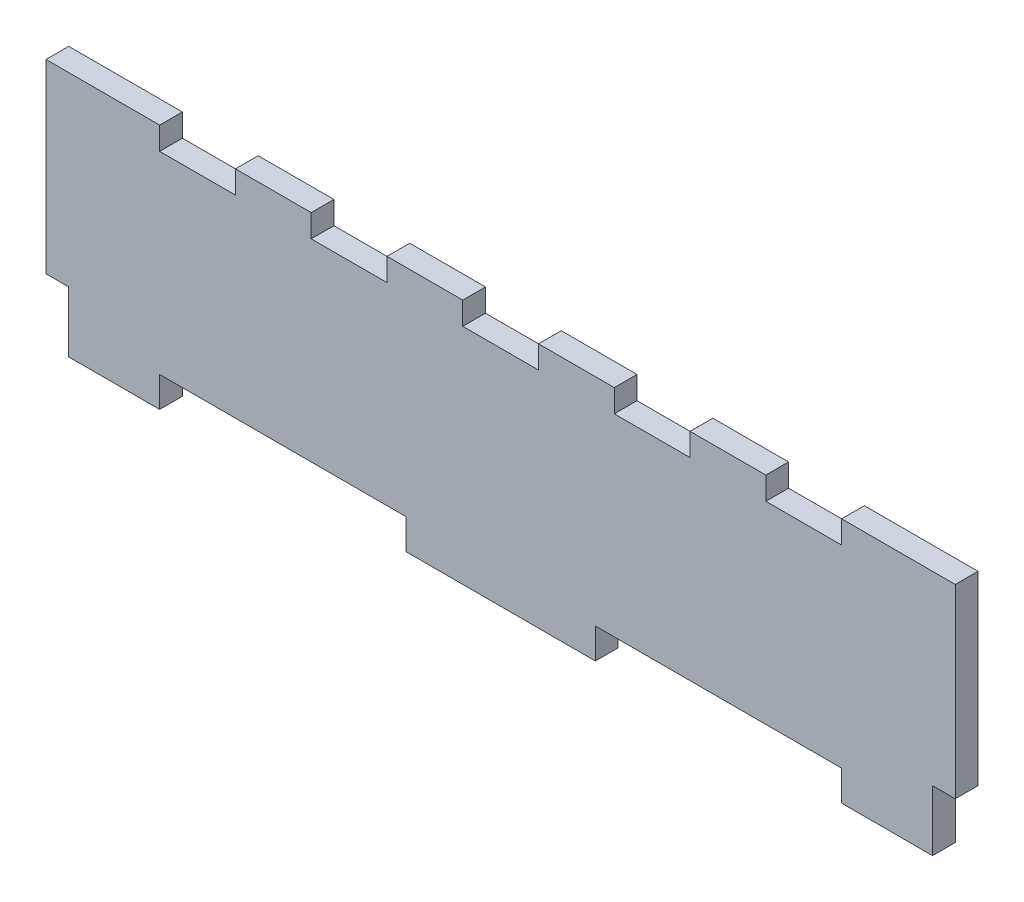
ISO-10303-21;
HEADER;
FILE_DESCRIPTION(('STEP AP214'),'2;1');
FILE_NAME('part.step','',(''),(''),'','','');
FILE_SCHEMA(('AUTOMOTIVE_DESIGN { 1 0 10303 214 1 1 1 1 }'));
ENDSEC;
DATA;
#1=APPLICATION_CONTEXT('core data for automotive mechanical design processes');
#2=APPLICATION_PROTOCOL_DEFINITION('international standard','automotive_design',2000,#1);
#3=PRODUCT_CONTEXT('',#1,'mechanical');
#4=PRODUCT('Part','Part','',(#3));
#5=PRODUCT_RELATED_PRODUCT_CATEGORY('part','',(#4));
#6=PRODUCT_DEFINITION_FORMATION('','',#4);
#7=PRODUCT_DEFINITION_CONTEXT('part definition',#1,'design');
#8=PRODUCT_DEFINITION('design','',#6,#7);
#9=PRODUCT_DEFINITION_SHAPE('','',#8);
#10=(LENGTH_UNIT() NAMED_UNIT(*) SI_UNIT(.MILLI.,.METRE.));
#11=(NAMED_UNIT(*) PLANE_ANGLE_UNIT() SI_UNIT($,.RADIAN.));
#12=(NAMED_UNIT(*) SI_UNIT($,.STERADIAN.) SOLID_ANGLE_UNIT());
#13=UNCERTAINTY_MEASURE_WITH_UNIT(LENGTH_MEASURE(1.E-05),#10,'distance_accuracy_value','');
#14=(GEOMETRIC_REPRESENTATION_CONTEXT(3) GLOBAL_UNCERTAINTY_ASSIGNED_CONTEXT((#13)) GLOBAL_UNIT_ASSIGNED_CONTEXT((#10,
#11,#12)) REPRESENTATION_CONTEXT('',''));
#15=CARTESIAN_POINT('',(0.,0.,0.));
#16=DIRECTION('',(0.,0.,1.));
#17=DIRECTION('',(1.,0.,0.));
#18=AXIS2_PLACEMENT_3D('',#15,#16,#17);
#19=CARTESIAN_POINT('',(-120.,32.5,3.));
#20=DIRECTION('',(0.,-1.,0.));
#21=DIRECTION('',(0.,0.,-1.));
#22=AXIS2_PLACEMENT_3D('',#19,#20,#21);
#23=PLANE('',#22);
#24=DIRECTION('',(-1.,0.,0.));
#25=VECTOR('',#24,1.);
#26=CARTESIAN_POINT('',(-120.,32.5,-3.));
#27=LINE('',#26,#25);
#28=CARTESIAN_POINT('',(-9.99999999999998,32.5,-3.));
#29=VERTEX_POINT('',#28);
#30=CARTESIAN_POINT('',(-30.,32.5,-3.));
#31=VERTEX_POINT('',#30);
#32=EDGE_CURVE('E564',#29,#31,#27,.T.);
#33=ORIENTED_EDGE('',*,*,#32,.T.);
#34=DIRECTION('',(0.,0.,1.));
#35=VECTOR('',#34,1.);
#36=CARTESIAN_POINT('',(-30.,32.5,-23.8806130178211));
#37=LINE('',#36,#35);
#38=CARTESIAN_POINT('',(-30.,32.5,3.));
#39=VERTEX_POINT('',#38);
#40=EDGE_CURVE('E273',#31,#39,#37,.T.);
#41=ORIENTED_EDGE('',*,*,#40,.T.);
#42=DIRECTION('',(-1.,0.,0.));
#43=VECTOR('',#42,1.);
#44=CARTESIAN_POINT('',(-120.,32.5,3.));
#45=LINE('',#44,#43);
#46=CARTESIAN_POINT('',(-9.99999999999998,32.5,3.));
#47=VERTEX_POINT('',#46);
#48=EDGE_CURVE('E549',#47,#39,#45,.T.);
#49=ORIENTED_EDGE('',*,*,#48,.F.);
#50=DIRECTION('',(0.,0.,1.));
#51=VECTOR('',#50,1.);
#52=CARTESIAN_POINT('',(-9.99999999999998,32.5,-23.8806130178211));
#53=LINE('',#52,#51);
#54=EDGE_CURVE('E318',#29,#47,#53,.T.);
#55=ORIENTED_EDGE('',*,*,#54,.F.);
#56=EDGE_LOOP('',(#33,#41,#49,#55));
#57=FACE_BOUND('',#56,.T.);
#58=ADVANCED_FACE('F35',(#57),#23,.F.);
#59=CARTESIAN_POINT('',(30.,32.5,-3.));
#60=VERTEX_POINT('',#59);
#61=CARTESIAN_POINT('',(10.,32.5,-3.));
#62=VERTEX_POINT('',#61);
#63=EDGE_CURVE('E565',#60,#62,#27,.T.);
#64=ORIENTED_EDGE('',*,*,#63,.T.);
#65=DIRECTION('',(0.,0.,1.));
#66=VECTOR('',#65,1.);
#67=CARTESIAN_POINT('',(10.,32.5,-23.8806130178211));
#68=LINE('',#67,#66);
#69=CARTESIAN_POINT('',(10.,32.5,3.));
#70=VERTEX_POINT('',#69);
#71=EDGE_CURVE('E322',#62,#70,#68,.T.);
#72=ORIENTED_EDGE('',*,*,#71,.T.);
#73=CARTESIAN_POINT('',(30.,32.5,3.));
#74=VERTEX_POINT('',#73);
#75=EDGE_CURVE('E551',#74,#70,#45,.T.);
#76=ORIENTED_EDGE('',*,*,#75,.F.);
#77=DIRECTION('',(0.,0.,1.));
#78=VECTOR('',#77,1.);
#79=CARTESIAN_POINT('',(30.,32.5,-23.8806130178211));
#80=LINE('',#79,#78);
#81=EDGE_CURVE('E344',#60,#74,#80,.T.);
#82=ORIENTED_EDGE('',*,*,#81,.F.);
#83=EDGE_LOOP('',(#64,#72,#76,#82));
#84=FACE_BOUND('',#83,.T.);
#85=ADVANCED_FACE('F585',(#84),#23,.F.);
#86=CARTESIAN_POINT('',(70.,32.5,-3.));
#87=VERTEX_POINT('',#86);
#88=CARTESIAN_POINT('',(50.,32.5,-3.));
#89=VERTEX_POINT('',#88);
#90=EDGE_CURVE('E517',#87,#89,#27,.T.);
#91=ORIENTED_EDGE('',*,*,#90,.T.);
#92=DIRECTION('',(0.,0.,1.));
#93=VECTOR('',#92,1.);
#94=CARTESIAN_POINT('',(50.,32.5,-23.8806130178211));
#95=LINE('',#94,#93);
#96=CARTESIAN_POINT('',(50.,32.5,3.));
#97=VERTEX_POINT('',#96);
#98=EDGE_CURVE('E348',#89,#97,#95,.T.);
#99=ORIENTED_EDGE('',*,*,#98,.T.);
#100=CARTESIAN_POINT('',(70.,32.5,3.));
#101=VERTEX_POINT('',#100);
#102=EDGE_CURVE('E502',#101,#97,#45,.T.);
#103=ORIENTED_EDGE('',*,*,#102,.F.);
#104=DIRECTION('',(0.,0.,1.));
#105=VECTOR('',#104,1.);
#106=CARTESIAN_POINT('',(70.,32.5,-23.8806130178211));
#107=LINE('',#106,#105);
#108=EDGE_CURVE('E369',#87,#101,#107,.T.);
#109=ORIENTED_EDGE('',*,*,#108,.F.);
#110=EDGE_LOOP('',(#91,#99,#103,#109));
#111=FACE_BOUND('',#110,.T.);
#112=ADVANCED_FACE('F574',(#111),#23,.F.);
#113=CARTESIAN_POINT('',(120.,32.5,-3.));
#114=VERTEX_POINT('',#113);
#115=CARTESIAN_POINT('',(90.,32.5,-3.));
#116=VERTEX_POINT('',#115);
#117=EDGE_CURVE('E513',#114,#116,#27,.T.);
#118=ORIENTED_EDGE('',*,*,#117,.T.);
#119=DIRECTION('',(0.,0.,1.));
#120=VECTOR('',#119,1.);
#121=CARTESIAN_POINT('',(90.,32.5,-23.8806130178211));
#122=LINE('',#121,#120);
#123=CARTESIAN_POINT('',(90.,32.5,3.));
#124=VERTEX_POINT('',#123);
#125=EDGE_CURVE('E373',#116,#124,#122,.T.);
#126=ORIENTED_EDGE('',*,*,#125,.T.);
#127=CARTESIAN_POINT('',(120.,32.5,3.));
#128=VERTEX_POINT('',#127);
#129=EDGE_CURVE('E498',#128,#124,#45,.T.);
#130=ORIENTED_EDGE('',*,*,#129,.F.);
#131=DIRECTION('',(0.,0.,-1.));
#132=VECTOR('',#131,1.);
#133=CARTESIAN_POINT('',(120.,32.5,3.));
#134=LINE('',#133,#132);
#135=EDGE_CURVE('E11',#128,#114,#134,.T.);
#136=ORIENTED_EDGE('',*,*,#135,.T.);
#137=EDGE_LOOP('',(#118,#126,#130,#136));
#138=FACE_BOUND('',#137,.T.);
#139=ADVANCED_FACE('F618',(#138),#23,.F.);
#140=CARTESIAN_POINT('',(-50.,32.5,3.));
#141=VERTEX_POINT('',#140);
#142=CARTESIAN_POINT('',(-70.,32.5,3.));
#143=VERTEX_POINT('',#142);
#144=EDGE_CURVE('E503',#141,#143,#45,.T.);
#145=ORIENTED_EDGE('',*,*,#144,.F.);
#146=DIRECTION('',(0.,0.,1.));
#147=VECTOR('',#146,1.);
#148=CARTESIAN_POINT('',(-50.,32.5,-23.8806130178211));
#149=LINE('',#148,#147);
#150=CARTESIAN_POINT('',(-50.,32.5,-3.));
#151=VERTEX_POINT('',#150);
#152=EDGE_CURVE('E297',#151,#141,#149,.T.);
#153=ORIENTED_EDGE('',*,*,#152,.F.);
#154=CARTESIAN_POINT('',(-70.,32.5,-3.));
#155=VERTEX_POINT('',#154);
#156=EDGE_CURVE('E518',#151,#155,#27,.T.);
#157=ORIENTED_EDGE('',*,*,#156,.T.);
#158=DIRECTION('',(0.,0.,1.));
#159=VECTOR('',#158,1.);
#160=CARTESIAN_POINT('',(-70.,32.5,-23.8806130178211));
#161=LINE('',#160,#159);
#162=EDGE_CURVE('E399',#155,#143,#161,.T.);
#163=ORIENTED_EDGE('',*,*,#162,.T.);
#164=EDGE_LOOP('',(#145,#153,#157,#163));
#165=FACE_BOUND('',#164,.T.);
#166=ADVANCED_FACE('F608',(#165),#23,.F.);
#167=CARTESIAN_POINT('',(-120.,-32.5,3.));
#168=DIRECTION('',(0.,1.,0.));
#169=DIRECTION('',(0.,0.,1.));
#170=AXIS2_PLACEMENT_3D('',#167,#168,#169);
#171=PLANE('',#170);
#172=DIRECTION('',(1.,0.,0.));
#173=VECTOR('',#172,1.);
#174=CARTESIAN_POINT('',(-120.,-32.5,3.));
#175=LINE('',#174,#173);
#176=CARTESIAN_POINT('',(-25.,-32.5,3.));
#177=VERTEX_POINT('',#176);
#178=CARTESIAN_POINT('',(25.,-32.5,3.));
#179=VERTEX_POINT('',#178);
#180=EDGE_CURVE('E510',#177,#179,#175,.T.);
#181=ORIENTED_EDGE('',*,*,#180,.F.);
#182=DIRECTION('',(0.,0.,1.));
#183=VECTOR('',#182,1.);
#184=CARTESIAN_POINT('',(-25.,-32.5,-68.4904573201318));
#185=LINE('',#184,#183);
#186=CARTESIAN_POINT('',(-25.,-32.5,-3.));
#187=VERTEX_POINT('',#186);
#188=EDGE_CURVE('E409',#187,#177,#185,.T.);
#189=ORIENTED_EDGE('',*,*,#188,.F.);
#190=DIRECTION('',(1.,0.,0.));
#191=VECTOR('',#190,1.);
#192=CARTESIAN_POINT('',(-120.,-32.5,-3.));
#193=LINE('',#192,#191);
#194=CARTESIAN_POINT('',(25.,-32.5,-3.));
#195=VERTEX_POINT('',#194);
#196=EDGE_CURVE('E523',#187,#195,#193,.T.);
#197=ORIENTED_EDGE('',*,*,#196,.T.);
#198=DIRECTION('',(0.,0.,1.));
#199=VECTOR('',#198,1.);
#200=CARTESIAN_POINT('',(25.,-32.5,-68.4904573201318));
#201=LINE('',#200,#199);
#202=EDGE_CURVE('E450',#195,#179,#201,.T.);
#203=ORIENTED_EDGE('',*,*,#202,.T.);
#204=EDGE_LOOP('',(#181,#189,#197,#203));
#205=FACE_BOUND('',#204,.T.);
#206=ADVANCED_FACE('F617',(#205),#171,.F.);
#207=CARTESIAN_POINT('',(90.,-32.5,3.));
#208=VERTEX_POINT('',#207);
#209=CARTESIAN_POINT('',(114.,-32.5,3.));
#210=VERTEX_POINT('',#209);
#211=EDGE_CURVE('E506',#208,#210,#175,.T.);
#212=ORIENTED_EDGE('',*,*,#211,.F.);
#213=DIRECTION('',(0.,0.,1.));
#214=VECTOR('',#213,1.);
#215=CARTESIAN_POINT('',(90.,-32.5,-68.4904573201318));
#216=LINE('',#215,#214);
#217=CARTESIAN_POINT('',(90.,-32.5,-3.));
#218=VERTEX_POINT('',#217);
#219=EDGE_CURVE('E415',#218,#208,#216,.T.);
#220=ORIENTED_EDGE('',*,*,#219,.F.);
#221=CARTESIAN_POINT('',(114.,-32.5,-3.));
#222=VERTEX_POINT('',#221);
#223=EDGE_CURVE('E521',#218,#222,#193,.T.);
#224=ORIENTED_EDGE('',*,*,#223,.T.);
#225=DIRECTION('',(0.,0.,1.));
#226=VECTOR('',#225,1.);
#227=CARTESIAN_POINT('',(114.,-32.5,-68.4904573201318));
#228=LINE('',#227,#226);
#229=EDGE_CURVE('E443',#222,#210,#228,.T.);
#230=ORIENTED_EDGE('',*,*,#229,.T.);
#231=EDGE_LOOP('',(#212,#220,#224,#230));
#232=FACE_BOUND('',#231,.T.);
#233=ADVANCED_FACE('F614',(#232),#171,.F.);
#234=CARTESIAN_POINT('',(120.,-32.5,3.));
#235=DIRECTION('',(-1.,0.,0.));
#236=DIRECTION('',(0.,0.,1.));
#237=AXIS2_PLACEMENT_3D('',#234,#235,#236);
#238=PLANE('',#237);
#239=DIRECTION('',(0.,1.,0.));
#240=VECTOR('',#239,1.);
#241=CARTESIAN_POINT('',(120.,-32.5,3.));
#242=LINE('',#241,#240);
#243=CARTESIAN_POINT('',(120.,-16.5,3.));
#244=VERTEX_POINT('',#243);
#245=EDGE_CURVE('E494',#244,#128,#242,.T.);
#246=ORIENTED_EDGE('',*,*,#245,.F.);
#247=DIRECTION('',(0.,0.,1.));
#248=VECTOR('',#247,1.);
#249=CARTESIAN_POINT('',(120.,-16.5,-68.4904573201318));
#250=LINE('',#249,#248);
#251=CARTESIAN_POINT('',(120.,-16.5,-3.));
#252=VERTEX_POINT('',#251);
#253=EDGE_CURVE('E462',#252,#244,#250,.T.);
#254=ORIENTED_EDGE('',*,*,#253,.F.);
#255=DIRECTION('',(0.,1.,0.));
#256=VECTOR('',#255,1.);
#257=CARTESIAN_POINT('',(120.,-32.5,-3.));
#258=LINE('',#257,#256);
#259=EDGE_CURVE('E491',#252,#114,#258,.T.);
#260=ORIENTED_EDGE('',*,*,#259,.T.);
#261=ORIENTED_EDGE('',*,*,#135,.F.);
#262=EDGE_LOOP('',(#246,#254,#260,#261));
#263=FACE_BOUND('',#262,.T.);
#264=ADVANCED_FACE('F37',(#263),#238,.F.);
#265=CARTESIAN_POINT('',(-90.,32.5,3.));
#266=VERTEX_POINT('',#265);
#267=CARTESIAN_POINT('',(-120.,32.5,3.));
#268=VERTEX_POINT('',#267);
#269=EDGE_CURVE('E496',#266,#268,#45,.T.);
#270=ORIENTED_EDGE('',*,*,#269,.F.);
#271=DIRECTION('',(0.,0.,1.));
#272=VECTOR('',#271,1.);
#273=CARTESIAN_POINT('',(-90.,32.5,-23.8806130178211));
#274=LINE('',#273,#272);
#275=CARTESIAN_POINT('',(-90.,32.5,-3.));
#276=VERTEX_POINT('',#275);
#277=EDGE_CURVE('E395',#276,#266,#274,.T.);
#278=ORIENTED_EDGE('',*,*,#277,.F.);
#279=CARTESIAN_POINT('',(-120.,32.5,-3.));
#280=VERTEX_POINT('',#279);
#281=EDGE_CURVE('E512',#276,#280,#27,.T.);
#282=ORIENTED_EDGE('',*,*,#281,.T.);
#283=DIRECTION('',(0.,0.,-1.));
#284=VECTOR('',#283,1.);
#285=CARTESIAN_POINT('',(-120.,32.5,3.));
#286=LINE('',#285,#284);
#287=EDGE_CURVE('E43',#268,#280,#286,.T.);
#288=ORIENTED_EDGE('',*,*,#287,.F.);
#289=EDGE_LOOP('',(#270,#278,#282,#288));
#290=FACE_BOUND('',#289,.T.);
#291=ADVANCED_FACE('F602',(#290),#23,.F.);
#292=CARTESIAN_POINT('',(-120.,-32.5,3.));
#293=DIRECTION('',(1.,0.,0.));
#294=DIRECTION('',(0.,0.,-1.));
#295=AXIS2_PLACEMENT_3D('',#292,#293,#294);
#296=PLANE('',#295);
#297=DIRECTION('',(0.,-1.,0.));
#298=VECTOR('',#297,1.);
#299=CARTESIAN_POINT('',(-120.,-32.5,-3.));
#300=LINE('',#299,#298);
#301=CARTESIAN_POINT('',(-120.,-16.5,-3.));
#302=VERTEX_POINT('',#301);
#303=EDGE_CURVE('E516',#280,#302,#300,.T.);
#304=ORIENTED_EDGE('',*,*,#303,.T.);
#305=DIRECTION('',(0.,0.,1.));
#306=VECTOR('',#305,1.);
#307=CARTESIAN_POINT('',(-120.,-16.5,-68.4904573201318));
#308=LINE('',#307,#306);
#309=CARTESIAN_POINT('',(-120.,-16.5,3.));
#310=VERTEX_POINT('',#309);
#311=EDGE_CURVE('E484',#302,#310,#308,.T.);
#312=ORIENTED_EDGE('',*,*,#311,.T.);
#313=DIRECTION('',(0.,-1.,0.));
#314=VECTOR('',#313,1.);
#315=CARTESIAN_POINT('',(-120.,-32.5,3.));
#316=LINE('',#315,#314);
#317=EDGE_CURVE('E501',#268,#310,#316,.T.);
#318=ORIENTED_EDGE('',*,*,#317,.F.);
#319=ORIENTED_EDGE('',*,*,#287,.T.);
#320=EDGE_LOOP('',(#304,#312,#318,#319));
#321=FACE_BOUND('',#320,.T.);
#322=ADVANCED_FACE('F529',(#321),#296,.F.);
#323=CARTESIAN_POINT('',(-114.,-32.5,-3.));
#324=VERTEX_POINT('',#323);
#325=CARTESIAN_POINT('',(-90.,-32.5,-3.));
#326=VERTEX_POINT('',#325);
#327=EDGE_CURVE('E497',#324,#326,#193,.T.);
#328=ORIENTED_EDGE('',*,*,#327,.T.);
#329=DIRECTION('',(0.,0.,1.));
#330=VECTOR('',#329,1.);
#331=CARTESIAN_POINT('',(-90.,-32.5,-68.4904573201318));
#332=LINE('',#331,#330);
#333=CARTESIAN_POINT('',(-90.,-32.5,3.));
#334=VERTEX_POINT('',#333);
#335=EDGE_CURVE('E419',#326,#334,#332,.T.);
#336=ORIENTED_EDGE('',*,*,#335,.T.);
#337=CARTESIAN_POINT('',(-114.,-32.5,3.));
#338=VERTEX_POINT('',#337);
#339=EDGE_CURVE('E507',#338,#334,#175,.T.);
#340=ORIENTED_EDGE('',*,*,#339,.F.);
#341=DIRECTION('',(0.,0.,1.));
#342=VECTOR('',#341,1.);
#343=CARTESIAN_POINT('',(-114.,-32.5,-68.4904573201318));
#344=LINE('',#343,#342);
#345=EDGE_CURVE('E478',#324,#338,#344,.T.);
#346=ORIENTED_EDGE('',*,*,#345,.F.);
#347=EDGE_LOOP('',(#328,#336,#340,#346));
#348=FACE_BOUND('',#347,.T.);
#349=ADVANCED_FACE('F613',(#348),#171,.F.);
#350=CARTESIAN_POINT('',(0.,0.,3.));
#351=DIRECTION('',(0.,0.,-1.));
#352=DIRECTION('',(-1.,0.,0.));
#353=AXIS2_PLACEMENT_3D('',#350,#351,#352);
#354=PLANE('',#353);
#355=ORIENTED_EDGE('',*,*,#48,.T.);
#356=DIRECTION('',(0.,1.,0.));
#357=VECTOR('',#356,1.);
#358=CARTESIAN_POINT('',(-30.,32.5,3.));
#359=LINE('',#358,#357);
#360=CARTESIAN_POINT('',(-30.,26.5,3.));
#361=VERTEX_POINT('',#360);
#362=EDGE_CURVE('E290',#361,#39,#359,.T.);
#363=ORIENTED_EDGE('',*,*,#362,.F.);
#364=DIRECTION('',(1.,0.,0.));
#365=VECTOR('',#364,1.);
#366=CARTESIAN_POINT('',(-50.,26.5,3.));
#367=LINE('',#366,#365);
#368=CARTESIAN_POINT('',(-50.,26.5,3.));
#369=VERTEX_POINT('',#368);
#370=EDGE_CURVE('E284',#369,#361,#367,.T.);
#371=ORIENTED_EDGE('',*,*,#370,.F.);
#372=DIRECTION('',(0.,-1.,0.));
#373=VECTOR('',#372,1.);
#374=CARTESIAN_POINT('',(-50.,32.5,3.));
#375=LINE('',#374,#373);
#376=EDGE_CURVE('E295',#141,#369,#375,.T.);
#377=ORIENTED_EDGE('',*,*,#376,.F.);
#378=ORIENTED_EDGE('',*,*,#144,.T.);
#379=DIRECTION('',(0.,1.,0.));
#380=VECTOR('',#379,1.);
#381=CARTESIAN_POINT('',(-70.,32.5,3.));
#382=LINE('',#381,#380);
#383=CARTESIAN_POINT('',(-70.,26.5,3.));
#384=VERTEX_POINT('',#383);
#385=EDGE_CURVE('E379',#384,#143,#382,.T.);
#386=ORIENTED_EDGE('',*,*,#385,.F.);
#387=DIRECTION('',(1.,0.,0.));
#388=VECTOR('',#387,1.);
#389=CARTESIAN_POINT('',(-90.,26.5,3.));
#390=LINE('',#389,#388);
#391=CARTESIAN_POINT('',(-90.,26.5,3.));
#392=VERTEX_POINT('',#391);
#393=EDGE_CURVE('E383',#392,#384,#390,.T.);
#394=ORIENTED_EDGE('',*,*,#393,.F.);
#395=DIRECTION('',(0.,-1.,0.));
#396=VECTOR('',#395,1.);
#397=CARTESIAN_POINT('',(-90.,32.5,3.));
#398=LINE('',#397,#396);
#399=EDGE_CURVE('E302',#266,#392,#398,.T.);
#400=ORIENTED_EDGE('',*,*,#399,.F.);
#401=ORIENTED_EDGE('',*,*,#269,.T.);
#402=ORIENTED_EDGE('',*,*,#317,.T.);
#403=DIRECTION('',(-1.,0.,0.));
#404=VECTOR('',#403,1.);
#405=CARTESIAN_POINT('',(-120.,-16.5,3.));
#406=LINE('',#405,#404);
#407=CARTESIAN_POINT('',(-114.,-16.5,3.));
#408=VERTEX_POINT('',#407);
#409=EDGE_CURVE('E476',#408,#310,#406,.T.);
#410=ORIENTED_EDGE('',*,*,#409,.F.);
#411=DIRECTION('',(0.,1.,0.));
#412=VECTOR('',#411,1.);
#413=CARTESIAN_POINT('',(-114.,-32.5,3.));
#414=LINE('',#413,#412);
#415=EDGE_CURVE('E433',#338,#408,#414,.T.);
#416=ORIENTED_EDGE('',*,*,#415,.F.);
#417=ORIENTED_EDGE('',*,*,#339,.T.);
#418=DIRECTION('',(0.,-1.,0.));
#419=VECTOR('',#418,1.);
#420=CARTESIAN_POINT('',(-90.,-32.5,3.));
#421=LINE('',#420,#419);
#422=CARTESIAN_POINT('',(-90.,-24.5,3.));
#423=VERTEX_POINT('',#422);
#424=EDGE_CURVE('E413',#423,#334,#421,.T.);
#425=ORIENTED_EDGE('',*,*,#424,.F.);
#426=DIRECTION('',(-1.,0.,0.));
#427=VECTOR('',#426,1.);
#428=CARTESIAN_POINT('',(-90.,-24.5,3.));
#429=LINE('',#428,#427);
#430=CARTESIAN_POINT('',(-25.,-24.5,3.));
#431=VERTEX_POINT('',#430);
#432=EDGE_CURVE('E406',#431,#423,#429,.T.);
#433=ORIENTED_EDGE('',*,*,#432,.F.);
#434=DIRECTION('',(0.,1.,0.));
#435=VECTOR('',#434,1.);
#436=CARTESIAN_POINT('',(-25.,-32.5,3.));
#437=LINE('',#436,#435);
#438=EDGE_CURVE('E410',#177,#431,#437,.T.);
#439=ORIENTED_EDGE('',*,*,#438,.F.);
#440=ORIENTED_EDGE('',*,*,#180,.T.);
#441=DIRECTION('',(0.,-1.,0.));
#442=VECTOR('',#441,1.);
#443=CARTESIAN_POINT('',(25.,-32.5,3.));
#444=LINE('',#443,#442);
#445=CARTESIAN_POINT('',(25.,-24.5,3.));
#446=VERTEX_POINT('',#445);
#447=EDGE_CURVE('E434',#446,#179,#444,.T.);
#448=ORIENTED_EDGE('',*,*,#447,.F.);
#449=DIRECTION('',(-1.,0.,0.));
#450=VECTOR('',#449,1.);
#451=CARTESIAN_POINT('',(90.,-24.5,3.));
#452=LINE('',#451,#450);
#453=CARTESIAN_POINT('',(90.,-24.5,3.));
#454=VERTEX_POINT('',#453);
#455=EDGE_CURVE('E437',#454,#446,#452,.T.);
#456=ORIENTED_EDGE('',*,*,#455,.F.);
#457=DIRECTION('',(0.,1.,0.));
#458=VECTOR('',#457,1.);
#459=CARTESIAN_POINT('',(90.,-32.5,3.));
#460=LINE('',#459,#458);
#461=EDGE_CURVE('E440',#208,#454,#460,.T.);
#462=ORIENTED_EDGE('',*,*,#461,.F.);
#463=ORIENTED_EDGE('',*,*,#211,.T.);
#464=DIRECTION('',(0.,-1.,0.));
#465=VECTOR('',#464,1.);
#466=CARTESIAN_POINT('',(114.,-32.5,3.));
#467=LINE('',#466,#465);
#468=CARTESIAN_POINT('',(114.,-16.5,3.));
#469=VERTEX_POINT('',#468);
#470=EDGE_CURVE('E460',#469,#210,#467,.T.);
#471=ORIENTED_EDGE('',*,*,#470,.F.);
#472=DIRECTION('',(-1.,0.,0.));
#473=VECTOR('',#472,1.);
#474=CARTESIAN_POINT('',(120.,-16.5,3.));
#475=LINE('',#474,#473);
#476=EDGE_CURVE('E405',#244,#469,#475,.T.);
#477=ORIENTED_EDGE('',*,*,#476,.F.);
#478=ORIENTED_EDGE('',*,*,#245,.T.);
#479=ORIENTED_EDGE('',*,*,#129,.T.);
#480=DIRECTION('',(0.,1.,0.));
#481=VECTOR('',#480,1.);
#482=CARTESIAN_POINT('',(90.,32.5,3.));
#483=LINE('',#482,#481);
#484=CARTESIAN_POINT('',(90.,26.5,3.));
#485=VERTEX_POINT('',#484);
#486=EDGE_CURVE('E354',#485,#124,#483,.T.);
#487=ORIENTED_EDGE('',*,*,#486,.F.);
#488=DIRECTION('',(1.,0.,0.));
#489=VECTOR('',#488,1.);
#490=CARTESIAN_POINT('',(70.,26.5,3.));
#491=LINE('',#490,#489);
#492=CARTESIAN_POINT('',(70.,26.5,3.));
#493=VERTEX_POINT('',#492);
#494=EDGE_CURVE('E357',#493,#485,#491,.T.);
#495=ORIENTED_EDGE('',*,*,#494,.F.);
#496=DIRECTION('',(0.,-1.,0.));
#497=VECTOR('',#496,1.);
#498=CARTESIAN_POINT('',(70.,32.5,3.));
#499=LINE('',#498,#497);
#500=EDGE_CURVE('E360',#101,#493,#499,.T.);
#501=ORIENTED_EDGE('',*,*,#500,.F.);
#502=ORIENTED_EDGE('',*,*,#102,.T.);
#503=DIRECTION('',(0.,1.,0.));
#504=VECTOR('',#503,1.);
#505=CARTESIAN_POINT('',(50.,32.5,3.));
#506=LINE('',#505,#504);
#507=CARTESIAN_POINT('',(50.,26.5,3.));
#508=VERTEX_POINT('',#507);
#509=EDGE_CURVE('E328',#508,#97,#506,.T.);
#510=ORIENTED_EDGE('',*,*,#509,.F.);
#511=DIRECTION('',(1.,0.,0.));
#512=VECTOR('',#511,1.);
#513=CARTESIAN_POINT('',(30.,26.5,3.));
#514=LINE('',#513,#512);
#515=CARTESIAN_POINT('',(30.,26.5,3.));
#516=VERTEX_POINT('',#515);
#517=EDGE_CURVE('E331',#516,#508,#514,.T.);
#518=ORIENTED_EDGE('',*,*,#517,.F.);
#519=DIRECTION('',(0.,-1.,0.));
#520=VECTOR('',#519,1.);
#521=CARTESIAN_POINT('',(30.,32.5,3.));
#522=LINE('',#521,#520);
#523=EDGE_CURVE('E334',#74,#516,#522,.T.);
#524=ORIENTED_EDGE('',*,*,#523,.F.);
#525=ORIENTED_EDGE('',*,*,#75,.T.);
#526=DIRECTION('',(0.,1.,0.));
#527=VECTOR('',#526,1.);
#528=CARTESIAN_POINT('',(10.,32.5,3.));
#529=LINE('',#528,#527);
#530=CARTESIAN_POINT('',(10.,26.5,3.));
#531=VERTEX_POINT('',#530);
#532=EDGE_CURVE('E303',#531,#70,#529,.T.);
#533=ORIENTED_EDGE('',*,*,#532,.F.);
#534=DIRECTION('',(1.,0.,0.));
#535=VECTOR('',#534,1.);
#536=CARTESIAN_POINT('',(-9.99999999999998,26.5,3.));
#537=LINE('',#536,#535);
#538=CARTESIAN_POINT('',(-9.99999999999998,26.5,3.));
#539=VERTEX_POINT('',#538);
#540=EDGE_CURVE('E306',#539,#531,#537,.T.);
#541=ORIENTED_EDGE('',*,*,#540,.F.);
#542=DIRECTION('',(0.,-1.,0.));
#543=VECTOR('',#542,1.);
#544=CARTESIAN_POINT('',(-9.99999999999998,32.5,3.));
#545=LINE('',#544,#543);
#546=EDGE_CURVE('E309',#47,#539,#545,.T.);
#547=ORIENTED_EDGE('',*,*,#546,.F.);
#548=EDGE_LOOP('',(#355,#363,#371,#377,#378,#386,#394,#400,#401,#402,#410,#416,#417,#425,#433,
#439,#440,#448,#456,#462,#463,#471,#477,#478,#479,#487,#495,#501,#502,#510,#518,#524,#525,#533,
#541,#547));
#549=FACE_BOUND('',#548,.T.);
#550=ADVANCED_FACE('F545',(#549),#354,.F.);
#551=CARTESIAN_POINT('',(0.,0.,-3.));
#552=DIRECTION('',(0.,0.,-1.));
#553=DIRECTION('',(-1.,0.,0.));
#554=AXIS2_PLACEMENT_3D('',#551,#552,#553);
#555=PLANE('',#554);
#556=DIRECTION('',(0.,1.,0.));
#557=VECTOR('',#556,1.);
#558=CARTESIAN_POINT('',(-30.,32.5,-3.));
#559=LINE('',#558,#557);
#560=CARTESIAN_POINT('',(-30.,26.5,-3.));
#561=VERTEX_POINT('',#560);
#562=EDGE_CURVE('E267',#561,#31,#559,.T.);
#563=ORIENTED_EDGE('',*,*,#562,.T.);
#564=ORIENTED_EDGE('',*,*,#32,.F.);
#565=DIRECTION('',(0.,-1.,0.));
#566=VECTOR('',#565,1.);
#567=CARTESIAN_POINT('',(-9.99999999999998,32.5,-3.));
#568=LINE('',#567,#566);
#569=CARTESIAN_POINT('',(-9.99999999999998,26.5,-3.));
#570=VERTEX_POINT('',#569);
#571=EDGE_CURVE('E315',#29,#570,#568,.T.);
#572=ORIENTED_EDGE('',*,*,#571,.T.);
#573=DIRECTION('',(1.,0.,0.));
#574=VECTOR('',#573,1.);
#575=CARTESIAN_POINT('',(-9.99999999999998,26.5,-3.));
#576=LINE('',#575,#574);
#577=CARTESIAN_POINT('',(10.,26.5,-3.));
#578=VERTEX_POINT('',#577);
#579=EDGE_CURVE('E305',#570,#578,#576,.T.);
#580=ORIENTED_EDGE('',*,*,#579,.T.);
#581=DIRECTION('',(0.,1.,0.));
#582=VECTOR('',#581,1.);
#583=CARTESIAN_POINT('',(10.,32.5,-3.));
#584=LINE('',#583,#582);
#585=EDGE_CURVE('E319',#578,#62,#584,.T.);
#586=ORIENTED_EDGE('',*,*,#585,.T.);
#587=ORIENTED_EDGE('',*,*,#63,.F.);
#588=DIRECTION('',(0.,-1.,0.));
#589=VECTOR('',#588,1.);
#590=CARTESIAN_POINT('',(30.,32.5,-3.));
#591=LINE('',#590,#589);
#592=CARTESIAN_POINT('',(30.,26.5,-3.));
#593=VERTEX_POINT('',#592);
#594=EDGE_CURVE('E341',#60,#593,#591,.T.);
#595=ORIENTED_EDGE('',*,*,#594,.T.);
#596=DIRECTION('',(1.,0.,0.));
#597=VECTOR('',#596,1.);
#598=CARTESIAN_POINT('',(30.,26.5,-3.));
#599=LINE('',#598,#597);
#600=CARTESIAN_POINT('',(50.,26.5,-3.));
#601=VERTEX_POINT('',#600);
#602=EDGE_CURVE('E330',#593,#601,#599,.T.);
#603=ORIENTED_EDGE('',*,*,#602,.T.);
#604=DIRECTION('',(0.,1.,0.));
#605=VECTOR('',#604,1.);
#606=CARTESIAN_POINT('',(50.,32.5,-3.));
#607=LINE('',#606,#605);
#608=EDGE_CURVE('E345',#601,#89,#607,.T.);
#609=ORIENTED_EDGE('',*,*,#608,.T.);
#610=ORIENTED_EDGE('',*,*,#90,.F.);
#611=DIRECTION('',(0.,-1.,0.));
#612=VECTOR('',#611,1.);
#613=CARTESIAN_POINT('',(70.,32.5,-3.));
#614=LINE('',#613,#612);
#615=CARTESIAN_POINT('',(70.,26.5,-3.));
#616=VERTEX_POINT('',#615);
#617=EDGE_CURVE('E366',#87,#616,#614,.T.);
#618=ORIENTED_EDGE('',*,*,#617,.T.);
#619=DIRECTION('',(1.,0.,0.));
#620=VECTOR('',#619,1.);
#621=CARTESIAN_POINT('',(70.,26.5,-3.));
#622=LINE('',#621,#620);
#623=CARTESIAN_POINT('',(90.,26.5,-3.));
#624=VERTEX_POINT('',#623);
#625=EDGE_CURVE('E356',#616,#624,#622,.T.);
#626=ORIENTED_EDGE('',*,*,#625,.T.);
#627=DIRECTION('',(0.,1.,0.));
#628=VECTOR('',#627,1.);
#629=CARTESIAN_POINT('',(90.,32.5,-3.));
#630=LINE('',#629,#628);
#631=EDGE_CURVE('E370',#624,#116,#630,.T.);
#632=ORIENTED_EDGE('',*,*,#631,.T.);
#633=ORIENTED_EDGE('',*,*,#117,.F.);
#634=ORIENTED_EDGE('',*,*,#259,.F.);
#635=DIRECTION('',(-1.,0.,0.));
#636=VECTOR('',#635,1.);
#637=CARTESIAN_POINT('',(120.,-16.5,-3.));
#638=LINE('',#637,#636);
#639=CARTESIAN_POINT('',(114.,-16.5,-3.));
#640=VERTEX_POINT('',#639);
#641=EDGE_CURVE('E469',#252,#640,#638,.T.);
#642=ORIENTED_EDGE('',*,*,#641,.T.);
#643=DIRECTION('',(0.,-1.,0.));
#644=VECTOR('',#643,1.);
#645=CARTESIAN_POINT('',(114.,-32.5,-3.));
#646=LINE('',#645,#644);
#647=EDGE_CURVE('E465',#640,#222,#646,.T.);
#648=ORIENTED_EDGE('',*,*,#647,.T.);
#649=ORIENTED_EDGE('',*,*,#223,.F.);
#650=DIRECTION('',(0.,1.,0.));
#651=VECTOR('',#650,1.);
#652=CARTESIAN_POINT('',(90.,-32.5,-3.));
#653=LINE('',#652,#651);
#654=CARTESIAN_POINT('',(90.,-24.5,-3.));
#655=VERTEX_POINT('',#654);
#656=EDGE_CURVE('E436',#218,#655,#653,.T.);
#657=ORIENTED_EDGE('',*,*,#656,.T.);
#658=DIRECTION('',(-1.,0.,0.));
#659=VECTOR('',#658,1.);
#660=CARTESIAN_POINT('',(90.,-24.5,-3.));
#661=LINE('',#660,#659);
#662=CARTESIAN_POINT('',(25.,-24.5,-3.));
#663=VERTEX_POINT('',#662);
#664=EDGE_CURVE('E452',#655,#663,#661,.T.);
#665=ORIENTED_EDGE('',*,*,#664,.T.);
#666=DIRECTION('',(0.,-1.,0.));
#667=VECTOR('',#666,1.);
#668=CARTESIAN_POINT('',(25.,-32.5,-3.));
#669=LINE('',#668,#667);
#670=EDGE_CURVE('E447',#663,#195,#669,.T.);
#671=ORIENTED_EDGE('',*,*,#670,.T.);
#672=ORIENTED_EDGE('',*,*,#196,.F.);
#673=DIRECTION('',(0.,1.,0.));
#674=VECTOR('',#673,1.);
#675=CARTESIAN_POINT('',(-25.,-32.5,-3.));
#676=LINE('',#675,#674);
#677=CARTESIAN_POINT('',(-25.,-24.5,-3.));
#678=VERTEX_POINT('',#677);
#679=EDGE_CURVE('E425',#187,#678,#676,.T.);
#680=ORIENTED_EDGE('',*,*,#679,.T.);
#681=DIRECTION('',(-1.,0.,0.));
#682=VECTOR('',#681,1.);
#683=CARTESIAN_POINT('',(-90.,-24.5,-3.));
#684=LINE('',#683,#682);
#685=CARTESIAN_POINT('',(-90.,-24.5,-3.));
#686=VERTEX_POINT('',#685);
#687=EDGE_CURVE('E421',#678,#686,#684,.T.);
#688=ORIENTED_EDGE('',*,*,#687,.T.);
#689=DIRECTION('',(0.,-1.,0.));
#690=VECTOR('',#689,1.);
#691=CARTESIAN_POINT('',(-90.,-32.5,-3.));
#692=LINE('',#691,#690);
#693=EDGE_CURVE('E416',#686,#326,#692,.T.);
#694=ORIENTED_EDGE('',*,*,#693,.T.);
#695=ORIENTED_EDGE('',*,*,#327,.F.);
#696=DIRECTION('',(0.,1.,0.));
#697=VECTOR('',#696,1.);
#698=CARTESIAN_POINT('',(-114.,-32.5,-3.));
#699=LINE('',#698,#697);
#700=CARTESIAN_POINT('',(-114.,-16.5,-3.));
#701=VERTEX_POINT('',#700);
#702=EDGE_CURVE('E486',#324,#701,#699,.T.);
#703=ORIENTED_EDGE('',*,*,#702,.T.);
#704=DIRECTION('',(-1.,0.,0.));
#705=VECTOR('',#704,1.);
#706=CARTESIAN_POINT('',(-120.,-16.5,-3.));
#707=LINE('',#706,#705);
#708=EDGE_CURVE('E481',#701,#302,#707,.T.);
#709=ORIENTED_EDGE('',*,*,#708,.T.);
#710=ORIENTED_EDGE('',*,*,#303,.F.);
#711=ORIENTED_EDGE('',*,*,#281,.F.);
#712=DIRECTION('',(0.,-1.,0.));
#713=VECTOR('',#712,1.);
#714=CARTESIAN_POINT('',(-90.,32.5,-3.));
#715=LINE('',#714,#713);
#716=CARTESIAN_POINT('',(-90.,26.5,-3.));
#717=VERTEX_POINT('',#716);
#718=EDGE_CURVE('E391',#276,#717,#715,.T.);
#719=ORIENTED_EDGE('',*,*,#718,.T.);
#720=DIRECTION('',(1.,0.,0.));
#721=VECTOR('',#720,1.);
#722=CARTESIAN_POINT('',(-90.,26.5,-3.));
#723=LINE('',#722,#721);
#724=CARTESIAN_POINT('',(-70.,26.5,-3.));
#725=VERTEX_POINT('',#724);
#726=EDGE_CURVE('E382',#717,#725,#723,.T.);
#727=ORIENTED_EDGE('',*,*,#726,.T.);
#728=DIRECTION('',(0.,1.,0.));
#729=VECTOR('',#728,1.);
#730=CARTESIAN_POINT('',(-70.,32.5,-3.));
#731=LINE('',#730,#729);
#732=EDGE_CURVE('E396',#725,#155,#731,.T.);
#733=ORIENTED_EDGE('',*,*,#732,.T.);
#734=ORIENTED_EDGE('',*,*,#156,.F.);
#735=DIRECTION('',(0.,-1.,0.));
#736=VECTOR('',#735,1.);
#737=CARTESIAN_POINT('',(-50.,32.5,-3.));
#738=LINE('',#737,#736);
#739=CARTESIAN_POINT('',(-50.,26.5,-3.));
#740=VERTEX_POINT('',#739);
#741=EDGE_CURVE('E289',#151,#740,#738,.T.);
#742=ORIENTED_EDGE('',*,*,#741,.T.);
#743=DIRECTION('',(1.,0.,0.));
#744=VECTOR('',#743,1.);
#745=CARTESIAN_POINT('',(-50.,26.5,-3.));
#746=LINE('',#745,#744);
#747=EDGE_CURVE('E281',#740,#561,#746,.T.);
#748=ORIENTED_EDGE('',*,*,#747,.T.);
#749=EDGE_LOOP('',(#563,#564,#572,#580,#586,#587,#595,#603,#609,#610,#618,#626,#632,#633,#634,
#642,#648,#649,#657,#665,#671,#672,#680,#688,#694,#695,#703,#709,#710,#711,#719,#727,#733,#734,
#742,#748));
#750=FACE_BOUND('',#749,.T.);
#751=ADVANCED_FACE('F287',(#750),#555,.T.);
#752=CARTESIAN_POINT('',(-114.,-32.5,-68.4904573201318));
#753=DIRECTION('',(1.,0.,0.));
#754=DIRECTION('',(0.,0.,-1.));
#755=AXIS2_PLACEMENT_3D('',#752,#753,#754);
#756=PLANE('',#755);
#757=ORIENTED_EDGE('',*,*,#345,.T.);
#758=ORIENTED_EDGE('',*,*,#415,.T.);
#759=DIRECTION('',(0.,0.,1.));
#760=VECTOR('',#759,1.);
#761=CARTESIAN_POINT('',(-114.,-16.5,-68.4904573201318));
#762=LINE('',#761,#760);
#763=EDGE_CURVE('E485',#701,#408,#762,.T.);
#764=ORIENTED_EDGE('',*,*,#763,.F.);
#765=ORIENTED_EDGE('',*,*,#702,.F.);
#766=EDGE_LOOP('',(#757,#758,#764,#765));
#767=FACE_BOUND('',#766,.T.);
#768=ADVANCED_FACE('F538',(#767),#756,.F.);
#769=CARTESIAN_POINT('',(-120.,-16.5,-68.4904573201318));
#770=DIRECTION('',(0.,1.,0.));
#771=DIRECTION('',(0.,0.,1.));
#772=AXIS2_PLACEMENT_3D('',#769,#770,#771);
#773=PLANE('',#772);
#774=ORIENTED_EDGE('',*,*,#763,.T.);
#775=ORIENTED_EDGE('',*,*,#409,.T.);
#776=ORIENTED_EDGE('',*,*,#311,.F.);
#777=ORIENTED_EDGE('',*,*,#708,.F.);
#778=EDGE_LOOP('',(#774,#775,#776,#777));
#779=FACE_BOUND('',#778,.T.);
#780=ADVANCED_FACE('F536',(#779),#773,.F.);
#781=CARTESIAN_POINT('',(120.,-16.5,-68.4904573201318));
#782=DIRECTION('',(0.,1.,0.));
#783=DIRECTION('',(0.,0.,1.));
#784=AXIS2_PLACEMENT_3D('',#781,#782,#783);
#785=PLANE('',#784);
#786=ORIENTED_EDGE('',*,*,#253,.T.);
#787=ORIENTED_EDGE('',*,*,#476,.T.);
#788=DIRECTION('',(0.,0.,1.));
#789=VECTOR('',#788,1.);
#790=CARTESIAN_POINT('',(114.,-16.5,-68.4904573201318));
#791=LINE('',#790,#789);
#792=EDGE_CURVE('E468',#640,#469,#791,.T.);
#793=ORIENTED_EDGE('',*,*,#792,.F.);
#794=ORIENTED_EDGE('',*,*,#641,.F.);
#795=EDGE_LOOP('',(#786,#787,#793,#794));
#796=FACE_BOUND('',#795,.T.);
#797=ADVANCED_FACE('F679',(#796),#785,.F.);
#798=CARTESIAN_POINT('',(114.,-32.5,-68.4904573201318));
#799=DIRECTION('',(-1.,0.,0.));
#800=DIRECTION('',(0.,0.,1.));
#801=AXIS2_PLACEMENT_3D('',#798,#799,#800);
#802=PLANE('',#801);
#803=ORIENTED_EDGE('',*,*,#792,.T.);
#804=ORIENTED_EDGE('',*,*,#470,.T.);
#805=ORIENTED_EDGE('',*,*,#229,.F.);
#806=ORIENTED_EDGE('',*,*,#647,.F.);
#807=EDGE_LOOP('',(#803,#804,#805,#806));
#808=FACE_BOUND('',#807,.T.);
#809=ADVANCED_FACE('F675',(#808),#802,.F.);
#810=CARTESIAN_POINT('',(90.,-32.5,-68.4904573201318));
#811=DIRECTION('',(1.,0.,0.));
#812=DIRECTION('',(0.,0.,-1.));
#813=AXIS2_PLACEMENT_3D('',#810,#811,#812);
#814=PLANE('',#813);
#815=ORIENTED_EDGE('',*,*,#219,.T.);
#816=ORIENTED_EDGE('',*,*,#461,.T.);
#817=DIRECTION('',(0.,0.,1.));
#818=VECTOR('',#817,1.);
#819=CARTESIAN_POINT('',(90.,-24.5,-68.4904573201318));
#820=LINE('',#819,#818);
#821=EDGE_CURVE('E446',#655,#454,#820,.T.);
#822=ORIENTED_EDGE('',*,*,#821,.F.);
#823=ORIENTED_EDGE('',*,*,#656,.F.);
#824=EDGE_LOOP('',(#815,#816,#822,#823));
#825=FACE_BOUND('',#824,.T.);
#826=ADVANCED_FACE('F671',(#825),#814,.F.);
#827=CARTESIAN_POINT('',(90.,-24.5,-68.4904573201318));
#828=DIRECTION('',(0.,1.,0.));
#829=DIRECTION('',(-1.,0.,0.));
#830=AXIS2_PLACEMENT_3D('',#827,#828,#829);
#831=PLANE('',#830);
#832=ORIENTED_EDGE('',*,*,#821,.T.);
#833=ORIENTED_EDGE('',*,*,#455,.T.);
#834=DIRECTION('',(0.,0.,1.));
#835=VECTOR('',#834,1.);
#836=CARTESIAN_POINT('',(25.,-24.5,-68.4904573201318));
#837=LINE('',#836,#835);
#838=EDGE_CURVE('E451',#663,#446,#837,.T.);
#839=ORIENTED_EDGE('',*,*,#838,.F.);
#840=ORIENTED_EDGE('',*,*,#664,.F.);
#841=EDGE_LOOP('',(#832,#833,#839,#840));
#842=FACE_BOUND('',#841,.T.);
#843=ADVANCED_FACE('F667',(#842),#831,.F.);
#844=CARTESIAN_POINT('',(25.,-32.5,-68.4904573201318));
#845=DIRECTION('',(-1.,0.,0.));
#846=DIRECTION('',(0.,-1.,0.));
#847=AXIS2_PLACEMENT_3D('',#844,#845,#846);
#848=PLANE('',#847);
#849=ORIENTED_EDGE('',*,*,#838,.T.);
#850=ORIENTED_EDGE('',*,*,#447,.T.);
#851=ORIENTED_EDGE('',*,*,#202,.F.);
#852=ORIENTED_EDGE('',*,*,#670,.F.);
#853=EDGE_LOOP('',(#849,#850,#851,#852));
#854=FACE_BOUND('',#853,.T.);
#855=ADVANCED_FACE('F663',(#854),#848,.F.);
#856=CARTESIAN_POINT('',(-25.,-32.5,-68.4904573201318));
#857=DIRECTION('',(1.,0.,0.));
#858=DIRECTION('',(0.,0.,-1.));
#859=AXIS2_PLACEMENT_3D('',#856,#857,#858);
#860=PLANE('',#859);
#861=ORIENTED_EDGE('',*,*,#188,.T.);
#862=ORIENTED_EDGE('',*,*,#438,.T.);
#863=DIRECTION('',(0.,0.,1.));
#864=VECTOR('',#863,1.);
#865=CARTESIAN_POINT('',(-25.,-24.5,-68.4904573201318));
#866=LINE('',#865,#864);
#867=EDGE_CURVE('E424',#678,#431,#866,.T.);
#868=ORIENTED_EDGE('',*,*,#867,.F.);
#869=ORIENTED_EDGE('',*,*,#679,.F.);
#870=EDGE_LOOP('',(#861,#862,#868,#869));
#871=FACE_BOUND('',#870,.T.);
#872=ADVANCED_FACE('F659',(#871),#860,.F.);
#873=CARTESIAN_POINT('',(-90.,-24.5,-68.4904573201318));
#874=DIRECTION('',(0.,1.,0.));
#875=DIRECTION('',(0.,0.,1.));
#876=AXIS2_PLACEMENT_3D('',#873,#874,#875);
#877=PLANE('',#876);
#878=ORIENTED_EDGE('',*,*,#867,.T.);
#879=ORIENTED_EDGE('',*,*,#432,.T.);
#880=DIRECTION('',(0.,0.,1.));
#881=VECTOR('',#880,1.);
#882=CARTESIAN_POINT('',(-90.,-24.5,-68.4904573201318));
#883=LINE('',#882,#881);
#884=EDGE_CURVE('E420',#686,#423,#883,.T.);
#885=ORIENTED_EDGE('',*,*,#884,.F.);
#886=ORIENTED_EDGE('',*,*,#687,.F.);
#887=EDGE_LOOP('',(#878,#879,#885,#886));
#888=FACE_BOUND('',#887,.T.);
#889=ADVANCED_FACE('F655',(#888),#877,.F.);
#890=CARTESIAN_POINT('',(-90.,-32.5,-68.4904573201318));
#891=DIRECTION('',(-1.,0.,0.));
#892=DIRECTION('',(0.,0.,1.));
#893=AXIS2_PLACEMENT_3D('',#890,#891,#892);
#894=PLANE('',#893);
#895=ORIENTED_EDGE('',*,*,#884,.T.);
#896=ORIENTED_EDGE('',*,*,#424,.T.);
#897=ORIENTED_EDGE('',*,*,#335,.F.);
#898=ORIENTED_EDGE('',*,*,#693,.F.);
#899=EDGE_LOOP('',(#895,#896,#897,#898));
#900=FACE_BOUND('',#899,.T.);
#901=ADVANCED_FACE('F652',(#900),#894,.F.);
#902=CARTESIAN_POINT('',(-90.,26.5,-23.8806130178211));
#903=DIRECTION('',(0.,-1.,0.));
#904=DIRECTION('',(0.,0.,-1.));
#905=AXIS2_PLACEMENT_3D('',#902,#903,#904);
#906=PLANE('',#905);
#907=DIRECTION('',(0.,0.,1.));
#908=VECTOR('',#907,1.);
#909=CARTESIAN_POINT('',(-90.,26.5,-23.8806130178211));
#910=LINE('',#909,#908);
#911=EDGE_CURVE('E394',#717,#392,#910,.T.);
#912=ORIENTED_EDGE('',*,*,#911,.T.);
#913=ORIENTED_EDGE('',*,*,#393,.T.);
#914=DIRECTION('',(0.,0.,1.));
#915=VECTOR('',#914,1.);
#916=CARTESIAN_POINT('',(-70.,26.5,-23.8806130178211));
#917=LINE('',#916,#915);
#918=EDGE_CURVE('E390',#725,#384,#917,.T.);
#919=ORIENTED_EDGE('',*,*,#918,.F.);
#920=ORIENTED_EDGE('',*,*,#726,.F.);
#921=EDGE_LOOP('',(#912,#913,#919,#920));
#922=FACE_BOUND('',#921,.T.);
#923=ADVANCED_FACE('F634',(#922),#906,.F.);
#924=CARTESIAN_POINT('',(-70.,32.5,-23.8806130178211));
#925=DIRECTION('',(1.,0.,0.));
#926=DIRECTION('',(0.,0.,-1.));
#927=AXIS2_PLACEMENT_3D('',#924,#925,#926);
#928=PLANE('',#927);
#929=ORIENTED_EDGE('',*,*,#918,.T.);
#930=ORIENTED_EDGE('',*,*,#385,.T.);
#931=ORIENTED_EDGE('',*,*,#162,.F.);
#932=ORIENTED_EDGE('',*,*,#732,.F.);
#933=EDGE_LOOP('',(#929,#930,#931,#932));
#934=FACE_BOUND('',#933,.T.);
#935=ADVANCED_FACE('F630',(#934),#928,.F.);
#936=CARTESIAN_POINT('',(-90.,32.5,-23.8806130178211));
#937=DIRECTION('',(-1.,0.,0.));
#938=DIRECTION('',(0.,0.,1.));
#939=AXIS2_PLACEMENT_3D('',#936,#937,#938);
#940=PLANE('',#939);
#941=ORIENTED_EDGE('',*,*,#277,.T.);
#942=ORIENTED_EDGE('',*,*,#399,.T.);
#943=ORIENTED_EDGE('',*,*,#911,.F.);
#944=ORIENTED_EDGE('',*,*,#718,.F.);
#945=EDGE_LOOP('',(#941,#942,#943,#944));
#946=FACE_BOUND('',#945,.T.);
#947=ADVANCED_FACE('F636',(#946),#940,.F.);
#948=CARTESIAN_POINT('',(70.,26.5,-23.8806130178211));
#949=DIRECTION('',(0.,-1.,0.));
#950=DIRECTION('',(0.,0.,-1.));
#951=AXIS2_PLACEMENT_3D('',#948,#949,#950);
#952=PLANE('',#951);
#953=DIRECTION('',(0.,0.,1.));
#954=VECTOR('',#953,1.);
#955=CARTESIAN_POINT('',(70.,26.5,-23.8806130178211));
#956=LINE('',#955,#954);
#957=EDGE_CURVE('E337',#616,#493,#956,.T.);
#958=ORIENTED_EDGE('',*,*,#957,.T.);
#959=ORIENTED_EDGE('',*,*,#494,.T.);
#960=DIRECTION('',(0.,0.,1.));
#961=VECTOR('',#960,1.);
#962=CARTESIAN_POINT('',(90.,26.5,-23.8806130178211));
#963=LINE('',#962,#961);
#964=EDGE_CURVE('E365',#624,#485,#963,.T.);
#965=ORIENTED_EDGE('',*,*,#964,.F.);
#966=ORIENTED_EDGE('',*,*,#625,.F.);
#967=EDGE_LOOP('',(#958,#959,#965,#966));
#968=FACE_BOUND('',#967,.T.);
#969=ADVANCED_FACE('F638',(#968),#952,.F.);
#970=CARTESIAN_POINT('',(90.,32.5,-23.8806130178211));
#971=DIRECTION('',(1.,0.,0.));
#972=DIRECTION('',(0.,0.,-1.));
#973=AXIS2_PLACEMENT_3D('',#970,#971,#972);
#974=PLANE('',#973);
#975=ORIENTED_EDGE('',*,*,#964,.T.);
#976=ORIENTED_EDGE('',*,*,#486,.T.);
#977=ORIENTED_EDGE('',*,*,#125,.F.);
#978=ORIENTED_EDGE('',*,*,#631,.F.);
#979=EDGE_LOOP('',(#975,#976,#977,#978));
#980=FACE_BOUND('',#979,.T.);
#981=ADVANCED_FACE('F644',(#980),#974,.F.);
#982=CARTESIAN_POINT('',(70.,32.5,-23.8806130178211));
#983=DIRECTION('',(-1.,0.,0.));
#984=DIRECTION('',(0.,0.,1.));
#985=AXIS2_PLACEMENT_3D('',#982,#983,#984);
#986=PLANE('',#985);
#987=ORIENTED_EDGE('',*,*,#108,.T.);
#988=ORIENTED_EDGE('',*,*,#500,.T.);
#989=ORIENTED_EDGE('',*,*,#957,.F.);
#990=ORIENTED_EDGE('',*,*,#617,.F.);
#991=EDGE_LOOP('',(#987,#988,#989,#990));
#992=FACE_BOUND('',#991,.T.);
#993=ADVANCED_FACE('F731',(#992),#986,.F.);
#994=CARTESIAN_POINT('',(30.,26.5,-23.8806130178211));
#995=DIRECTION('',(0.,-1.,0.));
#996=DIRECTION('',(0.,0.,-1.));
#997=AXIS2_PLACEMENT_3D('',#994,#995,#996);
#998=PLANE('',#997);
#999=DIRECTION('',(0.,0.,1.));
#1000=VECTOR('',#999,1.);
#1001=CARTESIAN_POINT('',(30.,26.5,-23.8806130178211));
#1002=LINE('',#1001,#1000);
#1003=EDGE_CURVE('E311',#593,#516,#1002,.T.);
#1004=ORIENTED_EDGE('',*,*,#1003,.T.);
#1005=ORIENTED_EDGE('',*,*,#517,.T.);
#1006=DIRECTION('',(0.,0.,1.));
#1007=VECTOR('',#1006,1.);
#1008=CARTESIAN_POINT('',(50.,26.5,-23.8806130178211));
#1009=LINE('',#1008,#1007);
#1010=EDGE_CURVE('E340',#601,#508,#1009,.T.);
#1011=ORIENTED_EDGE('',*,*,#1010,.F.);
#1012=ORIENTED_EDGE('',*,*,#602,.F.);
#1013=EDGE_LOOP('',(#1004,#1005,#1011,#1012));
#1014=FACE_BOUND('',#1013,.T.);
#1015=ADVANCED_FACE('F580',(#1014),#998,.F.);
#1016=CARTESIAN_POINT('',(50.,32.5,-23.8806130178211));
#1017=DIRECTION('',(1.,0.,0.));
#1018=DIRECTION('',(0.,0.,-1.));
#1019=AXIS2_PLACEMENT_3D('',#1016,#1017,#1018);
#1020=PLANE('',#1019);
#1021=ORIENTED_EDGE('',*,*,#1010,.T.);
#1022=ORIENTED_EDGE('',*,*,#509,.T.);
#1023=ORIENTED_EDGE('',*,*,#98,.F.);
#1024=ORIENTED_EDGE('',*,*,#608,.F.);
#1025=EDGE_LOOP('',(#1021,#1022,#1023,#1024));
#1026=FACE_BOUND('',#1025,.T.);
#1027=ADVANCED_FACE('F578',(#1026),#1020,.F.);
#1028=CARTESIAN_POINT('',(30.,32.5,-23.8806130178211));
#1029=DIRECTION('',(-1.,0.,0.));
#1030=DIRECTION('',(0.,0.,1.));
#1031=AXIS2_PLACEMENT_3D('',#1028,#1029,#1030);
#1032=PLANE('',#1031);
#1033=ORIENTED_EDGE('',*,*,#81,.T.);
#1034=ORIENTED_EDGE('',*,*,#523,.T.);
#1035=ORIENTED_EDGE('',*,*,#1003,.F.);
#1036=ORIENTED_EDGE('',*,*,#594,.F.);
#1037=EDGE_LOOP('',(#1033,#1034,#1035,#1036));
#1038=FACE_BOUND('',#1037,.T.);
#1039=ADVANCED_FACE('F742',(#1038),#1032,.F.);
#1040=CARTESIAN_POINT('',(-9.99999999999998,26.5,-23.8806130178211));
#1041=DIRECTION('',(0.,-1.,0.));
#1042=DIRECTION('',(0.,0.,-1.));
#1043=AXIS2_PLACEMENT_3D('',#1040,#1041,#1042);
#1044=PLANE('',#1043);
#1045=DIRECTION('',(0.,0.,1.));
#1046=VECTOR('',#1045,1.);
#1047=CARTESIAN_POINT('',(-9.99999999999998,26.5,-23.8806130178211));
#1048=LINE('',#1047,#1046);
#1049=EDGE_CURVE('E58',#570,#539,#1048,.T.);
#1050=ORIENTED_EDGE('',*,*,#1049,.T.);
#1051=ORIENTED_EDGE('',*,*,#540,.T.);
#1052=DIRECTION('',(0.,0.,1.));
#1053=VECTOR('',#1052,1.);
#1054=CARTESIAN_POINT('',(10.,26.5,-23.8806130178211));
#1055=LINE('',#1054,#1053);
#1056=EDGE_CURVE('E314',#578,#531,#1055,.T.);
#1057=ORIENTED_EDGE('',*,*,#1056,.F.);
#1058=ORIENTED_EDGE('',*,*,#579,.F.);
#1059=EDGE_LOOP('',(#1050,#1051,#1057,#1058));
#1060=FACE_BOUND('',#1059,.T.);
#1061=ADVANCED_FACE('F591',(#1060),#1044,.F.);
#1062=CARTESIAN_POINT('',(10.,32.5,-23.8806130178211));
#1063=DIRECTION('',(1.,0.,0.));
#1064=DIRECTION('',(0.,0.,-1.));
#1065=AXIS2_PLACEMENT_3D('',#1062,#1063,#1064);
#1066=PLANE('',#1065);
#1067=ORIENTED_EDGE('',*,*,#1056,.T.);
#1068=ORIENTED_EDGE('',*,*,#532,.T.);
#1069=ORIENTED_EDGE('',*,*,#71,.F.);
#1070=ORIENTED_EDGE('',*,*,#585,.F.);
#1071=EDGE_LOOP('',(#1067,#1068,#1069,#1070));
#1072=FACE_BOUND('',#1071,.T.);
#1073=ADVANCED_FACE('F588',(#1072),#1066,.F.);
#1074=CARTESIAN_POINT('',(-9.99999999999998,32.5,-23.8806130178211));
#1075=DIRECTION('',(-1.,0.,0.));
#1076=DIRECTION('',(0.,0.,1.));
#1077=AXIS2_PLACEMENT_3D('',#1074,#1075,#1076);
#1078=PLANE('',#1077);
#1079=ORIENTED_EDGE('',*,*,#54,.T.);
#1080=ORIENTED_EDGE('',*,*,#546,.T.);
#1081=ORIENTED_EDGE('',*,*,#1049,.F.);
#1082=ORIENTED_EDGE('',*,*,#571,.F.);
#1083=EDGE_LOOP('',(#1079,#1080,#1081,#1082));
#1084=FACE_BOUND('',#1083,.T.);
#1085=ADVANCED_FACE('F592',(#1084),#1078,.F.);
#1086=CARTESIAN_POINT('',(-50.,26.5,-23.8806130178211));
#1087=DIRECTION('',(0.,-1.,0.));
#1088=DIRECTION('',(0.,0.,-1.));
#1089=AXIS2_PLACEMENT_3D('',#1086,#1087,#1088);
#1090=PLANE('',#1089);
#1091=DIRECTION('',(0.,0.,1.));
#1092=VECTOR('',#1091,1.);
#1093=CARTESIAN_POINT('',(-50.,26.5,-23.8806130178211));
#1094=LINE('',#1093,#1092);
#1095=EDGE_CURVE('E50',#740,#369,#1094,.T.);
#1096=ORIENTED_EDGE('',*,*,#1095,.T.);
#1097=ORIENTED_EDGE('',*,*,#370,.T.);
#1098=DIRECTION('',(0.,0.,1.));
#1099=VECTOR('',#1098,1.);
#1100=CARTESIAN_POINT('',(-30.,26.5,-23.8806130178211));
#1101=LINE('',#1100,#1099);
#1102=EDGE_CURVE('E270',#561,#361,#1101,.T.);
#1103=ORIENTED_EDGE('',*,*,#1102,.F.);
#1104=ORIENTED_EDGE('',*,*,#747,.F.);
#1105=EDGE_LOOP('',(#1096,#1097,#1103,#1104));
#1106=FACE_BOUND('',#1105,.T.);
#1107=ADVANCED_FACE('F280',(#1106),#1090,.F.);
#1108=CARTESIAN_POINT('',(-30.,32.5,-23.8806130178211));
#1109=DIRECTION('',(1.,0.,0.));
#1110=DIRECTION('',(0.,0.,-1.));
#1111=AXIS2_PLACEMENT_3D('',#1108,#1109,#1110);
#1112=PLANE('',#1111);
#1113=ORIENTED_EDGE('',*,*,#1102,.T.);
#1114=ORIENTED_EDGE('',*,*,#362,.T.);
#1115=ORIENTED_EDGE('',*,*,#40,.F.);
#1116=ORIENTED_EDGE('',*,*,#562,.F.);
#1117=EDGE_LOOP('',(#1113,#1114,#1115,#1116));
#1118=FACE_BOUND('',#1117,.T.);
#1119=ADVANCED_FACE('F269',(#1118),#1112,.F.);
#1120=CARTESIAN_POINT('',(-50.,32.5,-23.8806130178211));
#1121=DIRECTION('',(-1.,0.,0.));
#1122=DIRECTION('',(0.,0.,1.));
#1123=AXIS2_PLACEMENT_3D('',#1120,#1121,#1122);
#1124=PLANE('',#1123);
#1125=ORIENTED_EDGE('',*,*,#152,.T.);
#1126=ORIENTED_EDGE('',*,*,#376,.T.);
#1127=ORIENTED_EDGE('',*,*,#1095,.F.);
#1128=ORIENTED_EDGE('',*,*,#741,.F.);
#1129=EDGE_LOOP('',(#1125,#1126,#1127,#1128));
#1130=FACE_BOUND('',#1129,.T.);
#1131=ADVANCED_FACE('F773',(#1130),#1124,.F.);
#1132=CLOSED_SHELL('',(#58,#85,#112,#139,#166,#206,#233,#264,#291,#322,#349,#550,#751,#768,#780,
#797,#809,#826,#843,#855,#872,#889,#901,#923,#935,#947,#969,#981,#993,#1015,#1027,#1039,#1061,
#1073,#1085,#1107,#1119,#1131));
#1133=MANIFOLD_SOLID_BREP('B2',#1132);
#1134=ADVANCED_BREP_SHAPE_REPRESENTATION('',(#18,#1133),#14);
#1135=SHAPE_DEFINITION_REPRESENTATION(#9,#1134);
ENDSEC;
END-ISO-10303-21;
